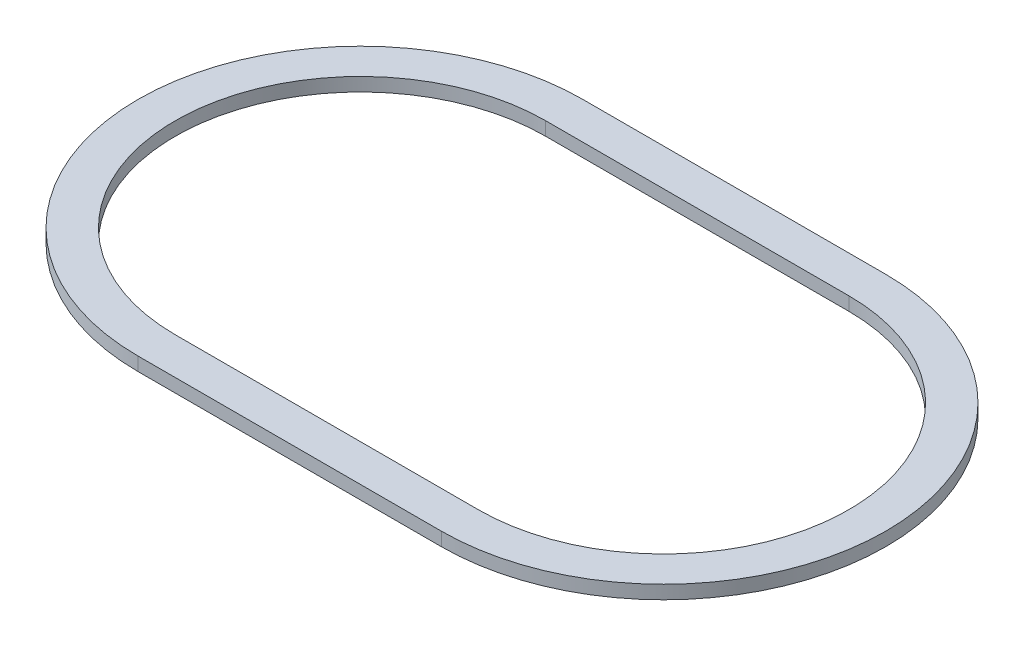
ISO-10303-21;
HEADER;
FILE_DESCRIPTION(('STEP AP214'),'2;1');
FILE_NAME('part.step','',(''),(''),'','','');
FILE_SCHEMA(('AUTOMOTIVE_DESIGN { 1 0 10303 214 1 1 1 1 }'));
ENDSEC;
DATA;
#1=APPLICATION_CONTEXT('core data for automotive mechanical design processes');
#2=APPLICATION_PROTOCOL_DEFINITION('international standard','automotive_design',2000,#1);
#3=PRODUCT_CONTEXT('',#1,'mechanical');
#4=PRODUCT('Part','Part','',(#3));
#5=PRODUCT_RELATED_PRODUCT_CATEGORY('part','',(#4));
#6=PRODUCT_DEFINITION_FORMATION('','',#4);
#7=PRODUCT_DEFINITION_CONTEXT('part definition',#1,'design');
#8=PRODUCT_DEFINITION('design','',#6,#7);
#9=PRODUCT_DEFINITION_SHAPE('','',#8);
#10=(LENGTH_UNIT() NAMED_UNIT(*) SI_UNIT(.MILLI.,.METRE.));
#11=(NAMED_UNIT(*) PLANE_ANGLE_UNIT() SI_UNIT($,.RADIAN.));
#12=(NAMED_UNIT(*) SI_UNIT($,.STERADIAN.) SOLID_ANGLE_UNIT());
#13=UNCERTAINTY_MEASURE_WITH_UNIT(LENGTH_MEASURE(1.E-05),#10,'distance_accuracy_value','');
#14=(GEOMETRIC_REPRESENTATION_CONTEXT(3) GLOBAL_UNCERTAINTY_ASSIGNED_CONTEXT((#13)) GLOBAL_UNIT_ASSIGNED_CONTEXT((#10,
#11,#12)) REPRESENTATION_CONTEXT('',''));
#15=CARTESIAN_POINT('',(0.,0.,0.));
#16=DIRECTION('',(0.,0.,1.));
#17=DIRECTION('',(1.,0.,0.));
#18=AXIS2_PLACEMENT_3D('',#15,#16,#17);
#19=CARTESIAN_POINT('',(22.5,2.,0.));
#20=DIRECTION('',(0.,-1.,0.));
#21=DIRECTION('',(0.,0.,-1.));
#22=AXIS2_PLACEMENT_3D('',#19,#20,#21);
#23=CYLINDRICAL_SURFACE('',#22,33.);
#24=CARTESIAN_POINT('',(22.5,0.,0.));
#25=DIRECTION('',(0.,1.,0.));
#26=DIRECTION('',(0.,0.,1.));
#27=AXIS2_PLACEMENT_3D('',#24,#25,#26);
#28=CIRCLE('',#27,33.);
#29=CARTESIAN_POINT('',(22.5,0.,33.));
#30=VERTEX_POINT('',#29);
#31=CARTESIAN_POINT('',(22.5,0.,-33.));
#32=VERTEX_POINT('',#31);
#33=EDGE_CURVE('E130',#30,#32,#28,.T.);
#34=ORIENTED_EDGE('',*,*,#33,.T.);
#35=DIRECTION('',(0.,-1.,0.));
#36=VECTOR('',#35,1.);
#37=CARTESIAN_POINT('',(22.5,2.,-33.));
#38=LINE('',#37,#36);
#39=CARTESIAN_POINT('',(22.5,2.,-33.));
#40=VERTEX_POINT('',#39);
#41=EDGE_CURVE('E11',#40,#32,#38,.T.);
#42=ORIENTED_EDGE('',*,*,#41,.F.);
#43=CARTESIAN_POINT('',(22.5,2.,0.));
#44=DIRECTION('',(0.,1.,0.));
#45=DIRECTION('',(0.,0.,1.));
#46=AXIS2_PLACEMENT_3D('',#43,#44,#45);
#47=CIRCLE('',#46,33.);
#48=CARTESIAN_POINT('',(22.5,2.,33.));
#49=VERTEX_POINT('',#48);
#50=EDGE_CURVE('E134',#49,#40,#47,.T.);
#51=ORIENTED_EDGE('',*,*,#50,.F.);
#52=DIRECTION('',(0.,-1.,0.));
#53=VECTOR('',#52,1.);
#54=CARTESIAN_POINT('',(22.5,2.,33.));
#55=LINE('',#54,#53);
#56=EDGE_CURVE('E144',#49,#30,#55,.T.);
#57=ORIENTED_EDGE('',*,*,#56,.T.);
#58=EDGE_LOOP('',(#34,#42,#51,#57));
#59=FACE_BOUND('',#58,.T.);
#60=ADVANCED_FACE('F33',(#59),#23,.T.);
#61=CARTESIAN_POINT('',(-22.5,2.,-33.));
#62=DIRECTION('',(0.,0.,1.));
#63=DIRECTION('',(1.,0.,0.));
#64=AXIS2_PLACEMENT_3D('',#61,#62,#63);
#65=PLANE('',#64);
#66=DIRECTION('',(-1.,0.,0.));
#67=VECTOR('',#66,1.);
#68=CARTESIAN_POINT('',(-22.5,0.,-33.));
#69=LINE('',#68,#67);
#70=CARTESIAN_POINT('',(-22.5,0.,-33.));
#71=VERTEX_POINT('',#70);
#72=EDGE_CURVE('E147',#32,#71,#69,.T.);
#73=ORIENTED_EDGE('',*,*,#72,.T.);
#74=DIRECTION('',(0.,-1.,0.));
#75=VECTOR('',#74,1.);
#76=CARTESIAN_POINT('',(-22.5,2.,-33.));
#77=LINE('',#76,#75);
#78=CARTESIAN_POINT('',(-22.5,2.,-33.));
#79=VERTEX_POINT('',#78);
#80=EDGE_CURVE('E40',#79,#71,#77,.T.);
#81=ORIENTED_EDGE('',*,*,#80,.F.);
#82=DIRECTION('',(-1.,0.,0.));
#83=VECTOR('',#82,1.);
#84=CARTESIAN_POINT('',(-22.5,2.,-33.));
#85=LINE('',#84,#83);
#86=EDGE_CURVE('E137',#40,#79,#85,.T.);
#87=ORIENTED_EDGE('',*,*,#86,.F.);
#88=ORIENTED_EDGE('',*,*,#41,.T.);
#89=EDGE_LOOP('',(#73,#81,#87,#88));
#90=FACE_BOUND('',#89,.T.);
#91=ADVANCED_FACE('F175',(#90),#65,.F.);
#92=CARTESIAN_POINT('',(-22.5,2.,0.));
#93=DIRECTION('',(0.,-1.,0.));
#94=DIRECTION('',(0.,0.,-1.));
#95=AXIS2_PLACEMENT_3D('',#92,#93,#94);
#96=CYLINDRICAL_SURFACE('',#95,33.);
#97=CARTESIAN_POINT('',(-22.5,0.,0.));
#98=DIRECTION('',(0.,1.,0.));
#99=DIRECTION('',(0.,0.,1.));
#100=AXIS2_PLACEMENT_3D('',#97,#98,#99);
#101=CIRCLE('',#100,33.);
#102=CARTESIAN_POINT('',(-22.5,0.,33.));
#103=VERTEX_POINT('',#102);
#104=EDGE_CURVE('E149',#71,#103,#101,.T.);
#105=ORIENTED_EDGE('',*,*,#104,.T.);
#106=DIRECTION('',(0.,-1.,0.));
#107=VECTOR('',#106,1.);
#108=CARTESIAN_POINT('',(-22.5,2.,33.));
#109=LINE('',#108,#107);
#110=CARTESIAN_POINT('',(-22.5,2.,33.));
#111=VERTEX_POINT('',#110);
#112=EDGE_CURVE('E154',#111,#103,#109,.T.);
#113=ORIENTED_EDGE('',*,*,#112,.F.);
#114=CARTESIAN_POINT('',(-22.5,2.,0.));
#115=DIRECTION('',(0.,1.,0.));
#116=DIRECTION('',(0.,0.,1.));
#117=AXIS2_PLACEMENT_3D('',#114,#115,#116);
#118=CIRCLE('',#117,33.);
#119=EDGE_CURVE('E140',#79,#111,#118,.T.);
#120=ORIENTED_EDGE('',*,*,#119,.F.);
#121=ORIENTED_EDGE('',*,*,#80,.T.);
#122=EDGE_LOOP('',(#105,#113,#120,#121));
#123=FACE_BOUND('',#122,.T.);
#124=ADVANCED_FACE('F161',(#123),#96,.T.);
#125=CARTESIAN_POINT('',(-22.5,2.,33.));
#126=DIRECTION('',(0.,0.,-1.));
#127=DIRECTION('',(-1.,0.,0.));
#128=AXIS2_PLACEMENT_3D('',#125,#126,#127);
#129=PLANE('',#128);
#130=DIRECTION('',(1.,0.,0.));
#131=VECTOR('',#130,1.);
#132=CARTESIAN_POINT('',(-22.5,0.,33.));
#133=LINE('',#132,#131);
#134=EDGE_CURVE('E138',#103,#30,#133,.T.);
#135=ORIENTED_EDGE('',*,*,#134,.T.);
#136=ORIENTED_EDGE('',*,*,#56,.F.);
#137=DIRECTION('',(1.,0.,0.));
#138=VECTOR('',#137,1.);
#139=CARTESIAN_POINT('',(-22.5,2.,33.));
#140=LINE('',#139,#138);
#141=EDGE_CURVE('E142',#111,#49,#140,.T.);
#142=ORIENTED_EDGE('',*,*,#141,.F.);
#143=ORIENTED_EDGE('',*,*,#112,.T.);
#144=EDGE_LOOP('',(#135,#136,#142,#143));
#145=FACE_BOUND('',#144,.T.);
#146=ADVANCED_FACE('F168',(#145),#129,.F.);
#147=CARTESIAN_POINT('',(22.5,2.,0.));
#148=DIRECTION('',(0.,1.,0.));
#149=DIRECTION('',(0.,0.,1.));
#150=AXIS2_PLACEMENT_3D('',#147,#148,#149);
#151=PLANE('',#150);
#152=CARTESIAN_POINT('',(22.5,2.,0.));
#153=DIRECTION('',(0.,1.,0.));
#154=DIRECTION('',(0.,0.,1.));
#155=AXIS2_PLACEMENT_3D('',#152,#153,#154);
#156=CIRCLE('',#155,27.5);
#157=CARTESIAN_POINT('',(22.5,2.,27.5));
#158=VERTEX_POINT('',#157);
#159=CARTESIAN_POINT('',(22.5,2.,-27.5));
#160=VERTEX_POINT('',#159);
#161=EDGE_CURVE('E47',#158,#160,#156,.T.);
#162=ORIENTED_EDGE('',*,*,#161,.F.);
#163=DIRECTION('',(1.,0.,0.));
#164=VECTOR('',#163,1.);
#165=CARTESIAN_POINT('',(-22.5,2.,27.5));
#166=LINE('',#165,#164);
#167=CARTESIAN_POINT('',(-22.5,2.,27.5));
#168=VERTEX_POINT('',#167);
#169=EDGE_CURVE('E115',#168,#158,#166,.T.);
#170=ORIENTED_EDGE('',*,*,#169,.F.);
#171=CARTESIAN_POINT('',(-22.5,2.,0.));
#172=DIRECTION('',(0.,1.,0.));
#173=DIRECTION('',(0.,0.,1.));
#174=AXIS2_PLACEMENT_3D('',#171,#172,#173);
#175=CIRCLE('',#174,27.5);
#176=CARTESIAN_POINT('',(-22.5,2.,-27.5));
#177=VERTEX_POINT('',#176);
#178=EDGE_CURVE('E118',#177,#168,#175,.T.);
#179=ORIENTED_EDGE('',*,*,#178,.F.);
#180=DIRECTION('',(-1.,0.,0.));
#181=VECTOR('',#180,1.);
#182=CARTESIAN_POINT('',(-22.5,2.,-27.5));
#183=LINE('',#182,#181);
#184=EDGE_CURVE('E124',#160,#177,#183,.T.);
#185=ORIENTED_EDGE('',*,*,#184,.F.);
#186=EDGE_LOOP('',(#162,#170,#179,#185));
#187=FACE_BOUND('',#186,.T.);
#188=ORIENTED_EDGE('',*,*,#50,.T.);
#189=ORIENTED_EDGE('',*,*,#86,.T.);
#190=ORIENTED_EDGE('',*,*,#119,.T.);
#191=ORIENTED_EDGE('',*,*,#141,.T.);
#192=EDGE_LOOP('',(#188,#189,#190,#191));
#193=FACE_BOUND('',#192,.T.);
#194=ADVANCED_FACE('F174',(#187,#193),#151,.T.);
#195=CARTESIAN_POINT('',(22.5,0.,0.));
#196=DIRECTION('',(0.,1.,0.));
#197=DIRECTION('',(0.,0.,1.));
#198=AXIS2_PLACEMENT_3D('',#195,#196,#197);
#199=PLANE('',#198);
#200=DIRECTION('',(1.,0.,0.));
#201=VECTOR('',#200,1.);
#202=CARTESIAN_POINT('',(-22.5,0.,27.5));
#203=LINE('',#202,#201);
#204=CARTESIAN_POINT('',(-22.5,0.,27.5));
#205=VERTEX_POINT('',#204);
#206=CARTESIAN_POINT('',(22.5,0.,27.5));
#207=VERTEX_POINT('',#206);
#208=EDGE_CURVE('E105',#205,#207,#203,.T.);
#209=ORIENTED_EDGE('',*,*,#208,.T.);
#210=CARTESIAN_POINT('',(22.5,0.,0.));
#211=DIRECTION('',(0.,1.,0.));
#212=DIRECTION('',(0.,0.,1.));
#213=AXIS2_PLACEMENT_3D('',#210,#211,#212);
#214=CIRCLE('',#213,27.5);
#215=CARTESIAN_POINT('',(22.5,0.,-27.5));
#216=VERTEX_POINT('',#215);
#217=EDGE_CURVE('E99',#207,#216,#214,.T.);
#218=ORIENTED_EDGE('',*,*,#217,.T.);
#219=DIRECTION('',(-1.,0.,0.));
#220=VECTOR('',#219,1.);
#221=CARTESIAN_POINT('',(-22.5,0.,-27.5));
#222=LINE('',#221,#220);
#223=CARTESIAN_POINT('',(-22.5,0.,-27.5));
#224=VERTEX_POINT('',#223);
#225=EDGE_CURVE('E108',#216,#224,#222,.T.);
#226=ORIENTED_EDGE('',*,*,#225,.T.);
#227=CARTESIAN_POINT('',(-22.5,0.,0.));
#228=DIRECTION('',(0.,1.,0.));
#229=DIRECTION('',(0.,0.,1.));
#230=AXIS2_PLACEMENT_3D('',#227,#228,#229);
#231=CIRCLE('',#230,27.5);
#232=EDGE_CURVE('E55',#224,#205,#231,.T.);
#233=ORIENTED_EDGE('',*,*,#232,.T.);
#234=EDGE_LOOP('',(#209,#218,#226,#233));
#235=FACE_BOUND('',#234,.T.);
#236=ORIENTED_EDGE('',*,*,#33,.F.);
#237=ORIENTED_EDGE('',*,*,#134,.F.);
#238=ORIENTED_EDGE('',*,*,#104,.F.);
#239=ORIENTED_EDGE('',*,*,#72,.F.);
#240=EDGE_LOOP('',(#236,#237,#238,#239));
#241=FACE_BOUND('',#240,.T.);
#242=ADVANCED_FACE('F112',(#235,#241),#199,.F.);
#243=CARTESIAN_POINT('',(22.5,0.,0.));
#244=DIRECTION('',(0.,1.,0.));
#245=DIRECTION('',(0.,0.,1.));
#246=AXIS2_PLACEMENT_3D('',#243,#244,#245);
#247=CYLINDRICAL_SURFACE('',#246,27.5);
#248=ORIENTED_EDGE('',*,*,#161,.T.);
#249=DIRECTION('',(0.,1.,0.));
#250=VECTOR('',#249,1.);
#251=CARTESIAN_POINT('',(22.5,0.,-27.5));
#252=LINE('',#251,#250);
#253=EDGE_CURVE('E95',#216,#160,#252,.T.);
#254=ORIENTED_EDGE('',*,*,#253,.F.);
#255=ORIENTED_EDGE('',*,*,#217,.F.);
#256=DIRECTION('',(0.,1.,0.));
#257=VECTOR('',#256,1.);
#258=CARTESIAN_POINT('',(22.5,0.,27.5));
#259=LINE('',#258,#257);
#260=EDGE_CURVE('E128',#207,#158,#259,.T.);
#261=ORIENTED_EDGE('',*,*,#260,.T.);
#262=EDGE_LOOP('',(#248,#254,#255,#261));
#263=FACE_BOUND('',#262,.T.);
#264=ADVANCED_FACE('F97',(#263),#247,.F.);
#265=CARTESIAN_POINT('',(-22.5,0.,27.5));
#266=DIRECTION('',(0.,0.,1.));
#267=DIRECTION('',(1.,0.,0.));
#268=AXIS2_PLACEMENT_3D('',#265,#266,#267);
#269=PLANE('',#268);
#270=ORIENTED_EDGE('',*,*,#169,.T.);
#271=ORIENTED_EDGE('',*,*,#260,.F.);
#272=ORIENTED_EDGE('',*,*,#208,.F.);
#273=DIRECTION('',(0.,1.,0.));
#274=VECTOR('',#273,1.);
#275=CARTESIAN_POINT('',(-22.5,0.,27.5));
#276=LINE('',#275,#274);
#277=EDGE_CURVE('E131',#205,#168,#276,.T.);
#278=ORIENTED_EDGE('',*,*,#277,.T.);
#279=EDGE_LOOP('',(#270,#271,#272,#278));
#280=FACE_BOUND('',#279,.T.);
#281=ADVANCED_FACE('F192',(#280),#269,.F.);
#282=CARTESIAN_POINT('',(-22.5,0.,0.));
#283=DIRECTION('',(0.,1.,0.));
#284=DIRECTION('',(0.,0.,1.));
#285=AXIS2_PLACEMENT_3D('',#282,#283,#284);
#286=CYLINDRICAL_SURFACE('',#285,27.5);
#287=ORIENTED_EDGE('',*,*,#178,.T.);
#288=ORIENTED_EDGE('',*,*,#277,.F.);
#289=ORIENTED_EDGE('',*,*,#232,.F.);
#290=DIRECTION('',(0.,1.,0.));
#291=VECTOR('',#290,1.);
#292=CARTESIAN_POINT('',(-22.5,0.,-27.5));
#293=LINE('',#292,#291);
#294=EDGE_CURVE('E104',#224,#177,#293,.T.);
#295=ORIENTED_EDGE('',*,*,#294,.T.);
#296=EDGE_LOOP('',(#287,#288,#289,#295));
#297=FACE_BOUND('',#296,.T.);
#298=ADVANCED_FACE('F195',(#297),#286,.F.);
#299=CARTESIAN_POINT('',(-22.5,0.,-27.5));
#300=DIRECTION('',(0.,0.,-1.));
#301=DIRECTION('',(-1.,0.,0.));
#302=AXIS2_PLACEMENT_3D('',#299,#300,#301);
#303=PLANE('',#302);
#304=ORIENTED_EDGE('',*,*,#184,.T.);
#305=ORIENTED_EDGE('',*,*,#294,.F.);
#306=ORIENTED_EDGE('',*,*,#225,.F.);
#307=ORIENTED_EDGE('',*,*,#253,.T.);
#308=EDGE_LOOP('',(#304,#305,#306,#307));
#309=FACE_BOUND('',#308,.T.);
#310=ADVANCED_FACE('F109',(#309),#303,.F.);
#311=CLOSED_SHELL('',(#60,#91,#124,#146,#194,#242,#264,#281,#298,#310));
#312=MANIFOLD_SOLID_BREP('B2',#311);
#313=ADVANCED_BREP_SHAPE_REPRESENTATION('',(#18,#312),#14);
#314=SHAPE_DEFINITION_REPRESENTATION(#9,#313);
ENDSEC;
END-ISO-10303-21;
